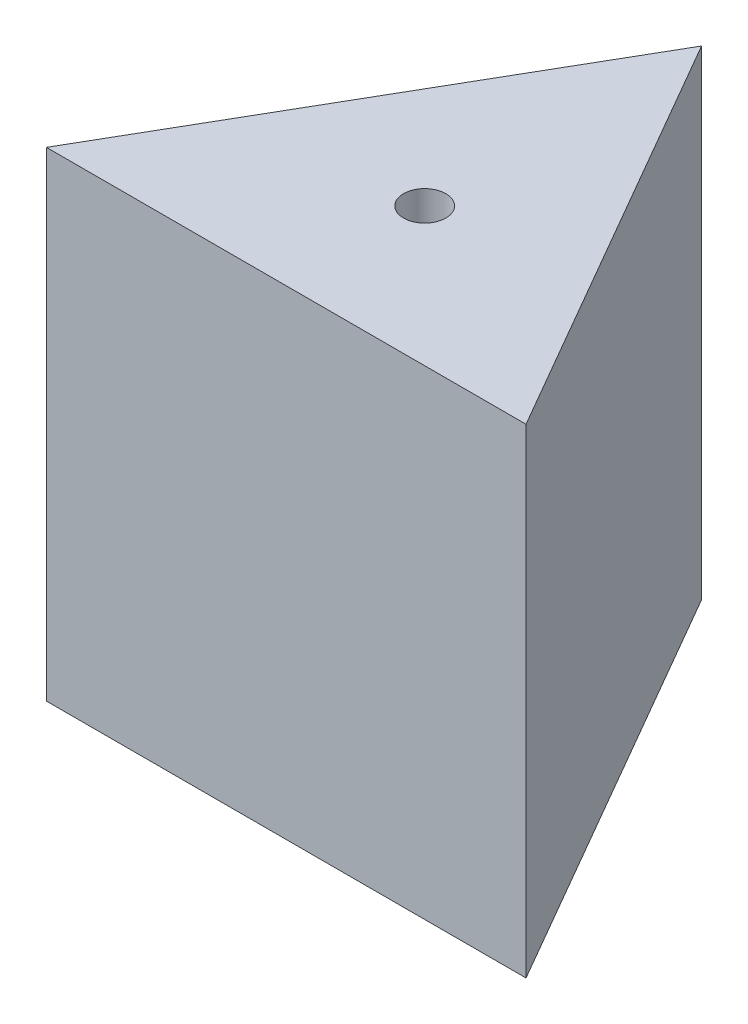
ISO-10303-21;
HEADER;
FILE_DESCRIPTION(('STEP AP214'),'2;1');
FILE_NAME('part.step','',(''),(''),'','','');
FILE_SCHEMA(('AUTOMOTIVE_DESIGN { 1 0 10303 214 1 1 1 1 }'));
ENDSEC;
DATA;
#1=APPLICATION_CONTEXT('core data for automotive mechanical design processes');
#2=APPLICATION_PROTOCOL_DEFINITION('international standard','automotive_design',2000,#1);
#3=PRODUCT_CONTEXT('',#1,'mechanical');
#4=PRODUCT('Part','Part','',(#3));
#5=PRODUCT_RELATED_PRODUCT_CATEGORY('part','',(#4));
#6=PRODUCT_DEFINITION_FORMATION('','',#4);
#7=PRODUCT_DEFINITION_CONTEXT('part definition',#1,'design');
#8=PRODUCT_DEFINITION('design','',#6,#7);
#9=PRODUCT_DEFINITION_SHAPE('','',#8);
#10=(LENGTH_UNIT() NAMED_UNIT(*) SI_UNIT(.MILLI.,.METRE.));
#11=(NAMED_UNIT(*) PLANE_ANGLE_UNIT() SI_UNIT($,.RADIAN.));
#12=(NAMED_UNIT(*) SI_UNIT($,.STERADIAN.) SOLID_ANGLE_UNIT());
#13=UNCERTAINTY_MEASURE_WITH_UNIT(LENGTH_MEASURE(1.E-05),#10,'distance_accuracy_value','');
#14=(GEOMETRIC_REPRESENTATION_CONTEXT(3) GLOBAL_UNCERTAINTY_ASSIGNED_CONTEXT((#13)) GLOBAL_UNIT_ASSIGNED_CONTEXT((#10,
#11,#12)) REPRESENTATION_CONTEXT('',''));
#15=CARTESIAN_POINT('',(0.,0.,0.));
#16=DIRECTION('',(0.,0.,1.));
#17=DIRECTION('',(1.,0.,0.));
#18=AXIS2_PLACEMENT_3D('',#15,#16,#17);
#19=CARTESIAN_POINT('',(215.9,431.8,373.949769354121));
#20=DIRECTION('',(-0.866025403784439,0.,0.5));
#21=DIRECTION('',(0.5,0.,0.866025403784439));
#22=AXIS2_PLACEMENT_3D('',#19,#20,#21);
#23=PLANE('',#22);
#24=DIRECTION('',(-0.5,0.,-0.866025403784439));
#25=VECTOR('',#24,1.);
#26=CARTESIAN_POINT('',(215.9,0.,373.949769354121));
#27=LINE('',#26,#25);
#28=CARTESIAN_POINT('',(215.9,0.,373.949769354121));
#29=VERTEX_POINT('',#28);
#30=CARTESIAN_POINT('',(0.,0.,0.));
#31=VERTEX_POINT('',#30);
#32=EDGE_CURVE('E79',#29,#31,#27,.T.);
#33=ORIENTED_EDGE('',*,*,#32,.T.);
#34=DIRECTION('',(0.,-1.,0.));
#35=VECTOR('',#34,1.);
#36=CARTESIAN_POINT('',(0.,431.8,0.));
#37=LINE('',#36,#35);
#38=CARTESIAN_POINT('',(0.,431.8,0.));
#39=VERTEX_POINT('',#38);
#40=EDGE_CURVE('E11',#39,#31,#37,.T.);
#41=ORIENTED_EDGE('',*,*,#40,.F.);
#42=DIRECTION('',(-0.5,0.,-0.866025403784439));
#43=VECTOR('',#42,1.);
#44=CARTESIAN_POINT('',(215.9,431.8,373.949769354121));
#45=LINE('',#44,#43);
#46=CARTESIAN_POINT('',(215.9,431.8,373.949769354121));
#47=VERTEX_POINT('',#46);
#48=EDGE_CURVE('E72',#47,#39,#45,.T.);
#49=ORIENTED_EDGE('',*,*,#48,.F.);
#50=DIRECTION('',(0.,-1.,0.));
#51=VECTOR('',#50,1.);
#52=CARTESIAN_POINT('',(215.9,431.8,373.949769354121));
#53=LINE('',#52,#51);
#54=EDGE_CURVE('E80',#47,#29,#53,.T.);
#55=ORIENTED_EDGE('',*,*,#54,.T.);
#56=EDGE_LOOP('',(#33,#41,#49,#55));
#57=FACE_BOUND('',#56,.T.);
#58=ADVANCED_FACE('F32',(#57),#23,.F.);
#59=CARTESIAN_POINT('',(0.,431.8,0.));
#60=DIRECTION('',(0.866025403784439,0.,0.5));
#61=DIRECTION('',(0.5,0.,-0.866025403784439));
#62=AXIS2_PLACEMENT_3D('',#59,#60,#61);
#63=PLANE('',#62);
#64=DIRECTION('',(-0.5,0.,0.866025403784439));
#65=VECTOR('',#64,1.);
#66=CARTESIAN_POINT('',(0.,0.,0.));
#67=LINE('',#66,#65);
#68=CARTESIAN_POINT('',(-215.9,0.,373.949769354121));
#69=VERTEX_POINT('',#68);
#70=EDGE_CURVE('E60',#31,#69,#67,.T.);
#71=ORIENTED_EDGE('',*,*,#70,.T.);
#72=DIRECTION('',(0.,-1.,0.));
#73=VECTOR('',#72,1.);
#74=CARTESIAN_POINT('',(-215.9,431.8,373.949769354121));
#75=LINE('',#74,#73);
#76=CARTESIAN_POINT('',(-215.9,431.8,373.949769354121));
#77=VERTEX_POINT('',#76);
#78=EDGE_CURVE('E40',#77,#69,#75,.T.);
#79=ORIENTED_EDGE('',*,*,#78,.F.);
#80=DIRECTION('',(-0.5,0.,0.866025403784439));
#81=VECTOR('',#80,1.);
#82=CARTESIAN_POINT('',(0.,431.8,0.));
#83=LINE('',#82,#81);
#84=EDGE_CURVE('E68',#39,#77,#83,.T.);
#85=ORIENTED_EDGE('',*,*,#84,.F.);
#86=ORIENTED_EDGE('',*,*,#40,.T.);
#87=EDGE_LOOP('',(#71,#79,#85,#86));
#88=FACE_BOUND('',#87,.T.);
#89=ADVANCED_FACE('F69',(#88),#63,.F.);
#90=CARTESIAN_POINT('',(-215.9,431.8,373.949769354121));
#91=DIRECTION('',(0.,0.,-1.));
#92=DIRECTION('',(-1.,0.,0.));
#93=AXIS2_PLACEMENT_3D('',#90,#91,#92);
#94=PLANE('',#93);
#95=DIRECTION('',(1.,0.,0.));
#96=VECTOR('',#95,1.);
#97=CARTESIAN_POINT('',(-215.9,0.,373.949769354121));
#98=LINE('',#97,#96);
#99=EDGE_CURVE('E65',#69,#29,#98,.T.);
#100=ORIENTED_EDGE('',*,*,#99,.T.);
#101=ORIENTED_EDGE('',*,*,#54,.F.);
#102=DIRECTION('',(1.,0.,0.));
#103=VECTOR('',#102,1.);
#104=CARTESIAN_POINT('',(-215.9,431.8,373.949769354121));
#105=LINE('',#104,#103);
#106=EDGE_CURVE('E48',#77,#47,#105,.T.);
#107=ORIENTED_EDGE('',*,*,#106,.F.);
#108=ORIENTED_EDGE('',*,*,#78,.T.);
#109=EDGE_LOOP('',(#100,#101,#107,#108));
#110=FACE_BOUND('',#109,.T.);
#111=ADVANCED_FACE('F91',(#110),#94,.F.);
#112=CARTESIAN_POINT('',(0.,431.8,0.));
#113=DIRECTION('',(0.,1.,0.));
#114=DIRECTION('',(0.,0.,1.));
#115=AXIS2_PLACEMENT_3D('',#112,#113,#114);
#116=PLANE('',#115);
#117=CARTESIAN_POINT('',(0.,431.8,249.29984623608));
#118=DIRECTION('',(0.,1.,0.));
#119=DIRECTION('',(0.,0.,1.));
#120=AXIS2_PLACEMENT_3D('',#117,#118,#119);
#121=CIRCLE('',#120,19.05);
#122=CARTESIAN_POINT('',(0.,431.8,268.34984623608));
#123=VERTEX_POINT('',#122);
#124=EDGE_CURVE('E86',#123,#123,#121,.T.);
#125=ORIENTED_EDGE('',*,*,#124,.F.);
#126=EDGE_LOOP('',(#125));
#127=FACE_BOUND('',#126,.T.);
#128=ORIENTED_EDGE('',*,*,#48,.T.);
#129=ORIENTED_EDGE('',*,*,#84,.T.);
#130=ORIENTED_EDGE('',*,*,#106,.T.);
#131=EDGE_LOOP('',(#128,#129,#130));
#132=FACE_BOUND('',#131,.T.);
#133=ADVANCED_FACE('F75',(#127,#132),#116,.T.);
#134=CARTESIAN_POINT('',(0.,0.,0.));
#135=DIRECTION('',(0.,1.,0.));
#136=DIRECTION('',(0.,0.,1.));
#137=AXIS2_PLACEMENT_3D('',#134,#135,#136);
#138=PLANE('',#137);
#139=CARTESIAN_POINT('',(0.,0.,249.29984623608));
#140=DIRECTION('',(0.,1.,0.));
#141=DIRECTION('',(0.,0.,1.));
#142=AXIS2_PLACEMENT_3D('',#139,#140,#141);
#143=CIRCLE('',#142,19.05);
#144=CARTESIAN_POINT('',(0.,0.,268.34984623608));
#145=VERTEX_POINT('',#144);
#146=EDGE_CURVE('E82',#145,#145,#143,.T.);
#147=ORIENTED_EDGE('',*,*,#146,.T.);
#148=EDGE_LOOP('',(#147));
#149=FACE_BOUND('',#148,.T.);
#150=ORIENTED_EDGE('',*,*,#32,.F.);
#151=ORIENTED_EDGE('',*,*,#99,.F.);
#152=ORIENTED_EDGE('',*,*,#70,.F.);
#153=EDGE_LOOP('',(#150,#151,#152));
#154=FACE_BOUND('',#153,.T.);
#155=ADVANCED_FACE('F92',(#149,#154),#138,.F.);
#156=CARTESIAN_POINT('',(0.,0.,249.29984623608));
#157=DIRECTION('',(0.,1.,0.));
#158=DIRECTION('',(0.,0.,1.));
#159=AXIS2_PLACEMENT_3D('',#156,#157,#158);
#160=CYLINDRICAL_SURFACE('',#159,19.05);
#161=ORIENTED_EDGE('',*,*,#146,.F.);
#162=EDGE_LOOP('',(#161));
#163=FACE_BOUND('',#162,.T.);
#164=ORIENTED_EDGE('',*,*,#124,.T.);
#165=EDGE_LOOP('',(#164));
#166=FACE_BOUND('',#165,.T.);
#167=ADVANCED_FACE('F94',(#163,#166),#160,.F.);
#168=CLOSED_SHELL('',(#58,#89,#111,#133,#155,#167));
#169=MANIFOLD_SOLID_BREP('B2',#168);
#170=ADVANCED_BREP_SHAPE_REPRESENTATION('',(#18,#169),#14);
#171=SHAPE_DEFINITION_REPRESENTATION(#9,#170);
ENDSEC;
END-ISO-10303-21;
